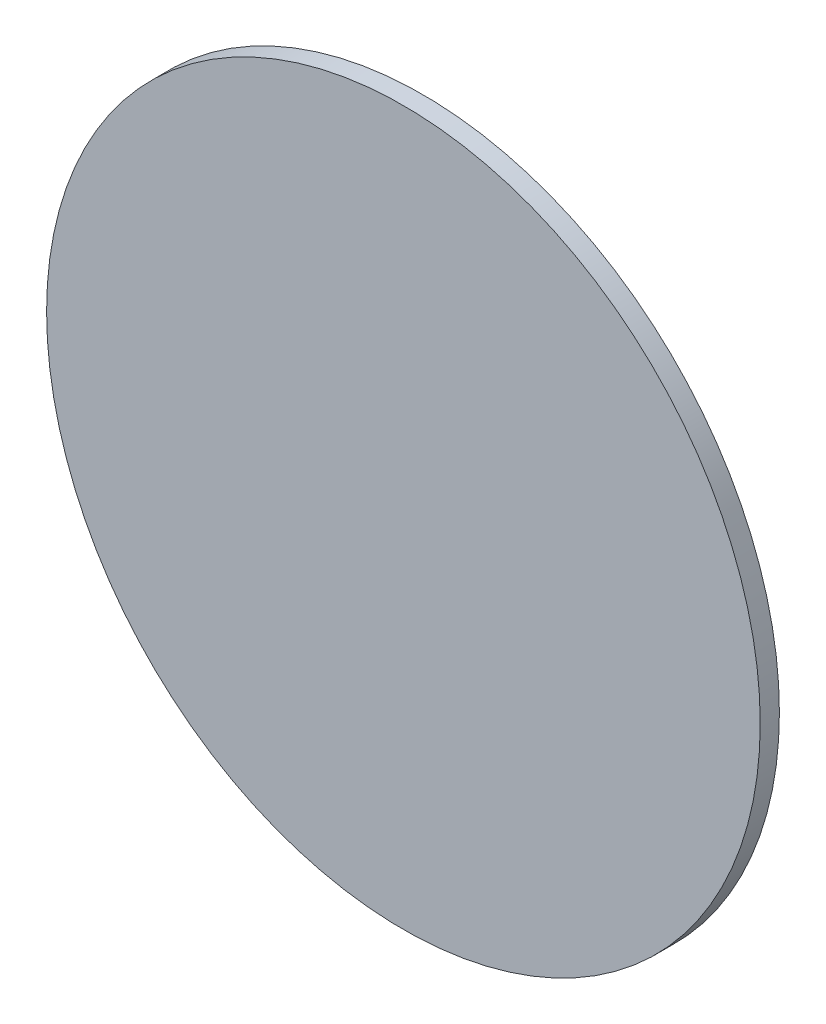
ISO-10303-21;
HEADER;
FILE_DESCRIPTION(('STEP AP214'),'2;1');
FILE_NAME('part.step','',(''),(''),'','','');
FILE_SCHEMA(('AUTOMOTIVE_DESIGN { 1 0 10303 214 1 1 1 1 }'));
ENDSEC;
DATA;
#1=APPLICATION_CONTEXT('core data for automotive mechanical design processes');
#2=APPLICATION_PROTOCOL_DEFINITION('international standard','automotive_design',2000,#1);
#3=PRODUCT_CONTEXT('',#1,'mechanical');
#4=PRODUCT('Part','Part','',(#3));
#5=PRODUCT_RELATED_PRODUCT_CATEGORY('part','',(#4));
#6=PRODUCT_DEFINITION_FORMATION('','',#4);
#7=PRODUCT_DEFINITION_CONTEXT('part definition',#1,'design');
#8=PRODUCT_DEFINITION('design','',#6,#7);
#9=PRODUCT_DEFINITION_SHAPE('','',#8);
#10=(LENGTH_UNIT() NAMED_UNIT(*) SI_UNIT(.MILLI.,.METRE.));
#11=(NAMED_UNIT(*) PLANE_ANGLE_UNIT() SI_UNIT($,.RADIAN.));
#12=(NAMED_UNIT(*) SI_UNIT($,.STERADIAN.) SOLID_ANGLE_UNIT());
#13=UNCERTAINTY_MEASURE_WITH_UNIT(LENGTH_MEASURE(1.E-05),#10,'distance_accuracy_value','');
#14=(GEOMETRIC_REPRESENTATION_CONTEXT(3) GLOBAL_UNCERTAINTY_ASSIGNED_CONTEXT((#13)) GLOBAL_UNIT_ASSIGNED_CONTEXT((#10,
#11,#12)) REPRESENTATION_CONTEXT('',''));
#15=CARTESIAN_POINT('',(0.,0.,0.));
#16=DIRECTION('',(0.,0.,1.));
#17=DIRECTION('',(1.,0.,0.));
#18=AXIS2_PLACEMENT_3D('',#15,#16,#17);
#19=CARTESIAN_POINT('',(0.,0.,-46.0248));
#20=DIRECTION('',(0.,0.,-1.));
#21=DIRECTION('',(-1.,0.,0.));
#22=AXIS2_PLACEMENT_3D('',#19,#20,#21);
#23=CYLINDRICAL_SURFACE('',#22,88.9);
#24=CARTESIAN_POINT('',(0.,0.,-46.0248));
#25=DIRECTION('',(0.,0.,1.));
#26=DIRECTION('',(1.,0.,0.));
#27=AXIS2_PLACEMENT_3D('',#24,#25,#26);
#28=CIRCLE('',#27,88.9);
#29=CARTESIAN_POINT('',(88.9,0.,-46.0248));
#30=VERTEX_POINT('',#29);
#31=EDGE_CURVE('E10',#30,#30,#28,.T.);
#32=ORIENTED_EDGE('',*,*,#31,.F.);
#33=EDGE_LOOP('',(#32));
#34=FACE_BOUND('',#33,.T.);
#35=CARTESIAN_POINT('',(0.,0.,-50.8));
#36=DIRECTION('',(0.,0.,1.));
#37=DIRECTION('',(1.,0.,0.));
#38=AXIS2_PLACEMENT_3D('',#35,#36,#37);
#39=CIRCLE('',#38,88.9);
#40=CARTESIAN_POINT('',(88.9,0.,-50.8));
#41=VERTEX_POINT('',#40);
#42=EDGE_CURVE('E42',#41,#41,#39,.T.);
#43=ORIENTED_EDGE('',*,*,#42,.T.);
#44=EDGE_LOOP('',(#43));
#45=FACE_BOUND('',#44,.T.);
#46=ADVANCED_FACE('F39',(#34,#45),#23,.T.);
#47=CARTESIAN_POINT('',(0.,0.,-46.0248));
#48=DIRECTION('',(0.,0.,1.));
#49=DIRECTION('',(1.,0.,0.));
#50=AXIS2_PLACEMENT_3D('',#47,#48,#49);
#51=PLANE('',#50);
#52=ORIENTED_EDGE('',*,*,#31,.T.);
#53=EDGE_LOOP('',(#52));
#54=FACE_BOUND('',#53,.T.);
#55=ADVANCED_FACE('F54',(#54),#51,.T.);
#56=CARTESIAN_POINT('',(0.,0.,-50.8));
#57=DIRECTION('',(0.,0.,1.));
#58=DIRECTION('',(1.,0.,0.));
#59=AXIS2_PLACEMENT_3D('',#56,#57,#58);
#60=PLANE('',#59);
#61=ORIENTED_EDGE('',*,*,#42,.F.);
#62=EDGE_LOOP('',(#61));
#63=FACE_BOUND('',#62,.T.);
#64=ADVANCED_FACE('F52',(#63),#60,.F.);
#65=CLOSED_SHELL('',(#46,#55,#64));
#66=MANIFOLD_SOLID_BREP('B2',#65);
#67=ADVANCED_BREP_SHAPE_REPRESENTATION('',(#18,#66),#14);
#68=SHAPE_DEFINITION_REPRESENTATION(#9,#67);
ENDSEC;
END-ISO-10303-21;
